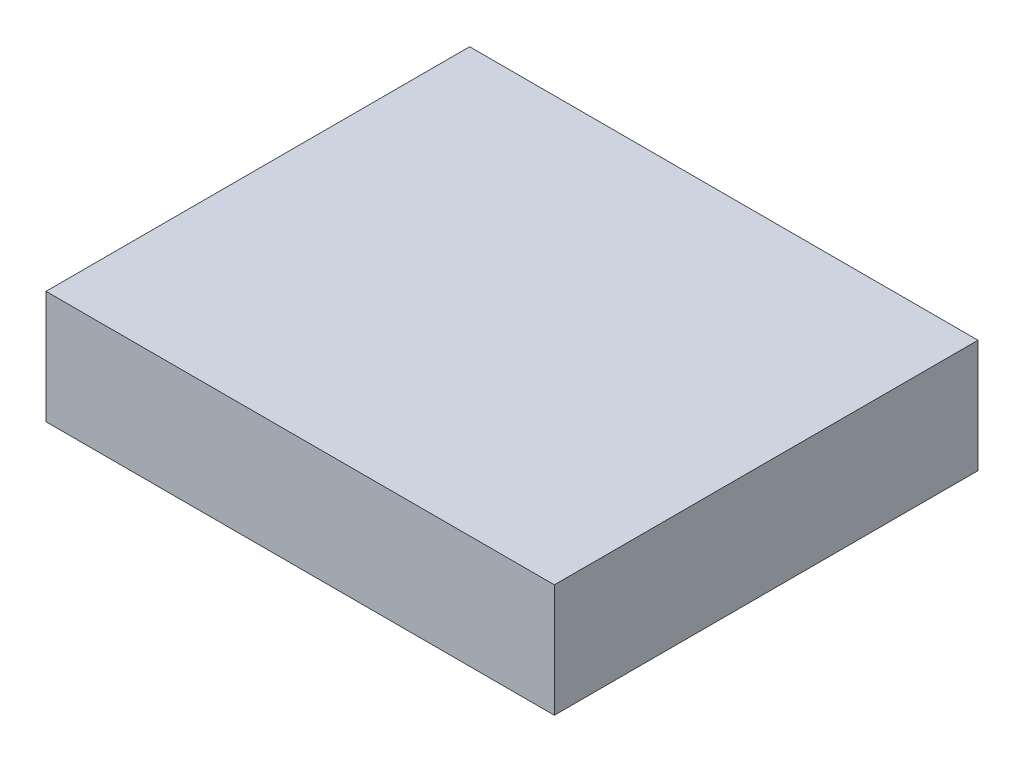
ISO-10303-21;
HEADER;
FILE_DESCRIPTION(('STEP AP214'),'2;1');
FILE_NAME('part.step','',(''),(''),'','','');
FILE_SCHEMA(('AUTOMOTIVE_DESIGN { 1 0 10303 214 1 1 1 1 }'));
ENDSEC;
DATA;
#1=APPLICATION_CONTEXT('core data for automotive mechanical design processes');
#2=APPLICATION_PROTOCOL_DEFINITION('international standard','automotive_design',2000,#1);
#3=PRODUCT_CONTEXT('',#1,'mechanical');
#4=PRODUCT('Part','Part','',(#3));
#5=PRODUCT_RELATED_PRODUCT_CATEGORY('part','',(#4));
#6=PRODUCT_DEFINITION_FORMATION('','',#4);
#7=PRODUCT_DEFINITION_CONTEXT('part definition',#1,'design');
#8=PRODUCT_DEFINITION('design','',#6,#7);
#9=PRODUCT_DEFINITION_SHAPE('','',#8);
#10=(LENGTH_UNIT() NAMED_UNIT(*) SI_UNIT(.MILLI.,.METRE.));
#11=(NAMED_UNIT(*) PLANE_ANGLE_UNIT() SI_UNIT($,.RADIAN.));
#12=(NAMED_UNIT(*) SI_UNIT($,.STERADIAN.) SOLID_ANGLE_UNIT());
#13=UNCERTAINTY_MEASURE_WITH_UNIT(LENGTH_MEASURE(1.E-05),#10,'distance_accuracy_value','');
#14=(GEOMETRIC_REPRESENTATION_CONTEXT(3) GLOBAL_UNCERTAINTY_ASSIGNED_CONTEXT((#13)) GLOBAL_UNIT_ASSIGNED_CONTEXT((#10,
#11,#12)) REPRESENTATION_CONTEXT('',''));
#15=CARTESIAN_POINT('',(0.,0.,0.));
#16=DIRECTION('',(0.,0.,1.));
#17=DIRECTION('',(1.,0.,0.));
#18=AXIS2_PLACEMENT_3D('',#15,#16,#17);
#19=CARTESIAN_POINT('',(-6.30000000000007,0.199999999999998,-5.75));
#20=DIRECTION('',(0.,-1.,0.));
#21=DIRECTION('',(0.,0.,-1.));
#22=AXIS2_PLACEMENT_3D('',#19,#20,#21);
#23=PLANE('',#22);
#24=DIRECTION('',(-1.,0.,0.));
#25=VECTOR('',#24,1.);
#26=CARTESIAN_POINT('',(-6.3,0.199999999999998,-4.25));
#27=LINE('',#26,#25);
#28=CARTESIAN_POINT('',(-6.3,0.199999999999998,-4.25));
#29=VERTEX_POINT('',#28);
#30=CARTESIAN_POINT('',(-4.5,0.199999999999998,-4.25));
#31=VERTEX_POINT('',#30);
#32=EDGE_CURVE('E80',#29,#31,#27,.F.);
#33=ORIENTED_EDGE('',*,*,#32,.T.);
#34=DIRECTION('',(0.,0.,1.));
#35=VECTOR('',#34,1.);
#36=CARTESIAN_POINT('',(-4.5,0.199999999999998,-4.25));
#37=LINE('',#36,#35);
#38=CARTESIAN_POINT('',(-4.5,0.199999999999998,-5.75));
#39=VERTEX_POINT('',#38);
#40=EDGE_CURVE('E55',#31,#39,#37,.F.);
#41=ORIENTED_EDGE('',*,*,#40,.T.);
#42=DIRECTION('',(1.,0.,0.));
#43=VECTOR('',#42,1.);
#44=CARTESIAN_POINT('',(-6.30000000000007,0.199999999999998,-5.75));
#45=LINE('',#44,#43);
#46=CARTESIAN_POINT('',(-6.30000000000003,0.199999999999998,-5.75));
#47=VERTEX_POINT('',#46);
#48=EDGE_CURVE('E57',#39,#47,#45,.F.);
#49=ORIENTED_EDGE('',*,*,#48,.T.);
#50=DIRECTION('',(0.,0.,-1.));
#51=VECTOR('',#50,1.);
#52=CARTESIAN_POINT('',(-6.3,0.199999999999998,-4.25));
#53=LINE('',#52,#51);
#54=EDGE_CURVE('E20',#47,#29,#53,.F.);
#55=ORIENTED_EDGE('',*,*,#54,.T.);
#56=EDGE_LOOP('',(#33,#41,#49,#55));
#57=FACE_BOUND('',#56,.T.);
#58=ADVANCED_FACE('F17',(#57),#23,.F.);
#59=CARTESIAN_POINT('',(-6.3,-0.200000000000001,-4.25));
#60=DIRECTION('',(1.,0.,0.));
#61=DIRECTION('',(0.,0.,-1.));
#62=AXIS2_PLACEMENT_3D('',#59,#60,#61);
#63=PLANE('',#62);
#64=ORIENTED_EDGE('',*,*,#54,.F.);
#65=DIRECTION('',(0.,1.,0.));
#66=VECTOR('',#65,1.);
#67=CARTESIAN_POINT('',(-6.30000000000007,-0.200000000000001,-5.75));
#68=LINE('',#67,#66);
#69=CARTESIAN_POINT('',(-6.30000000000005,-0.200000000000001,-5.75));
#70=VERTEX_POINT('',#69);
#71=EDGE_CURVE('E63',#47,#70,#68,.F.);
#72=ORIENTED_EDGE('',*,*,#71,.T.);
#73=DIRECTION('',(0.,0.,-1.));
#74=VECTOR('',#73,1.);
#75=CARTESIAN_POINT('',(-6.3,-0.200000000000001,-5.75));
#76=LINE('',#75,#74);
#77=CARTESIAN_POINT('',(-6.3,-0.200000000000001,-4.25));
#78=VERTEX_POINT('',#77);
#79=EDGE_CURVE('E83',#78,#70,#76,.T.);
#80=ORIENTED_EDGE('',*,*,#79,.F.);
#81=DIRECTION('',(0.,1.,0.));
#82=VECTOR('',#81,1.);
#83=CARTESIAN_POINT('',(-6.3,-0.200000000000001,-4.25));
#84=LINE('',#83,#82);
#85=EDGE_CURVE('E68',#78,#29,#84,.T.);
#86=ORIENTED_EDGE('',*,*,#85,.T.);
#87=EDGE_LOOP('',(#64,#72,#80,#86));
#88=FACE_BOUND('',#87,.T.);
#89=ADVANCED_FACE('F65',(#88),#63,.F.);
#90=CARTESIAN_POINT('',(-6.30000000000007,-0.200000000000001,-5.75));
#91=DIRECTION('',(0.,0.,1.));
#92=DIRECTION('',(1.,0.,0.));
#93=AXIS2_PLACEMENT_3D('',#90,#91,#92);
#94=PLANE('',#93);
#95=ORIENTED_EDGE('',*,*,#48,.F.);
#96=DIRECTION('',(0.,1.,0.));
#97=VECTOR('',#96,1.);
#98=CARTESIAN_POINT('',(-4.5,-0.200000000000001,-5.75));
#99=LINE('',#98,#97);
#100=CARTESIAN_POINT('',(-4.5,-0.200000000000001,-5.75));
#101=VERTEX_POINT('',#100);
#102=EDGE_CURVE('E75',#39,#101,#99,.F.);
#103=ORIENTED_EDGE('',*,*,#102,.T.);
#104=DIRECTION('',(1.,0.,0.));
#105=VECTOR('',#104,1.);
#106=CARTESIAN_POINT('',(-6.30000000000007,-0.200000000000001,-5.75));
#107=LINE('',#106,#105);
#108=EDGE_CURVE('E72',#70,#101,#107,.T.);
#109=ORIENTED_EDGE('',*,*,#108,.F.);
#110=ORIENTED_EDGE('',*,*,#71,.F.);
#111=EDGE_LOOP('',(#95,#103,#109,#110));
#112=FACE_BOUND('',#111,.T.);
#113=ADVANCED_FACE('F70',(#112),#94,.F.);
#114=CARTESIAN_POINT('',(-4.5,-0.200000000000001,-4.25));
#115=DIRECTION('',(-1.,0.,0.));
#116=DIRECTION('',(0.,0.,1.));
#117=AXIS2_PLACEMENT_3D('',#114,#115,#116);
#118=PLANE('',#117);
#119=ORIENTED_EDGE('',*,*,#40,.F.);
#120=DIRECTION('',(0.,1.,0.));
#121=VECTOR('',#120,1.);
#122=CARTESIAN_POINT('',(-4.5,-0.200000000000001,-4.25));
#123=LINE('',#122,#121);
#124=CARTESIAN_POINT('',(-4.5,-0.200000000000001,-4.25));
#125=VERTEX_POINT('',#124);
#126=EDGE_CURVE('E35',#31,#125,#123,.F.);
#127=ORIENTED_EDGE('',*,*,#126,.T.);
#128=DIRECTION('',(0.,0.,-1.));
#129=VECTOR('',#128,1.);
#130=CARTESIAN_POINT('',(-4.5,-0.200000000000001,-5.75));
#131=LINE('',#130,#129);
#132=EDGE_CURVE('E26',#101,#125,#131,.F.);
#133=ORIENTED_EDGE('',*,*,#132,.F.);
#134=ORIENTED_EDGE('',*,*,#102,.F.);
#135=EDGE_LOOP('',(#119,#127,#133,#134));
#136=FACE_BOUND('',#135,.T.);
#137=ADVANCED_FACE('F89',(#136),#118,.F.);
#138=CARTESIAN_POINT('',(-6.3,-0.200000000000001,-4.25));
#139=DIRECTION('',(0.,0.,-1.));
#140=DIRECTION('',(-1.,0.,0.));
#141=AXIS2_PLACEMENT_3D('',#138,#139,#140);
#142=PLANE('',#141);
#143=ORIENTED_EDGE('',*,*,#32,.F.);
#144=ORIENTED_EDGE('',*,*,#85,.F.);
#145=DIRECTION('',(1.,0.,0.));
#146=VECTOR('',#145,1.);
#147=CARTESIAN_POINT('',(-6.30000000000007,-0.200000000000001,-4.25));
#148=LINE('',#147,#146);
#149=EDGE_CURVE('E11',#125,#78,#148,.F.);
#150=ORIENTED_EDGE('',*,*,#149,.F.);
#151=ORIENTED_EDGE('',*,*,#126,.F.);
#152=EDGE_LOOP('',(#143,#144,#150,#151));
#153=FACE_BOUND('',#152,.T.);
#154=ADVANCED_FACE('F91',(#153),#142,.F.);
#155=CARTESIAN_POINT('',(-6.30000000000007,-0.200000000000001,-5.75));
#156=DIRECTION('',(0.,-1.,0.));
#157=DIRECTION('',(0.,0.,-1.));
#158=AXIS2_PLACEMENT_3D('',#155,#156,#157);
#159=PLANE('',#158);
#160=ORIENTED_EDGE('',*,*,#132,.T.);
#161=ORIENTED_EDGE('',*,*,#149,.T.);
#162=ORIENTED_EDGE('',*,*,#79,.T.);
#163=ORIENTED_EDGE('',*,*,#108,.T.);
#164=EDGE_LOOP('',(#160,#161,#162,#163));
#165=FACE_BOUND('',#164,.T.);
#166=ADVANCED_FACE('F88',(#165),#159,.T.);
#167=CLOSED_SHELL('',(#58,#89,#113,#137,#154,#166));
#168=MANIFOLD_SOLID_BREP('B1',#167);
#169=ADVANCED_BREP_SHAPE_REPRESENTATION('',(#18,#168),#14);
#170=SHAPE_DEFINITION_REPRESENTATION(#9,#169);
ENDSEC;
END-ISO-10303-21;
